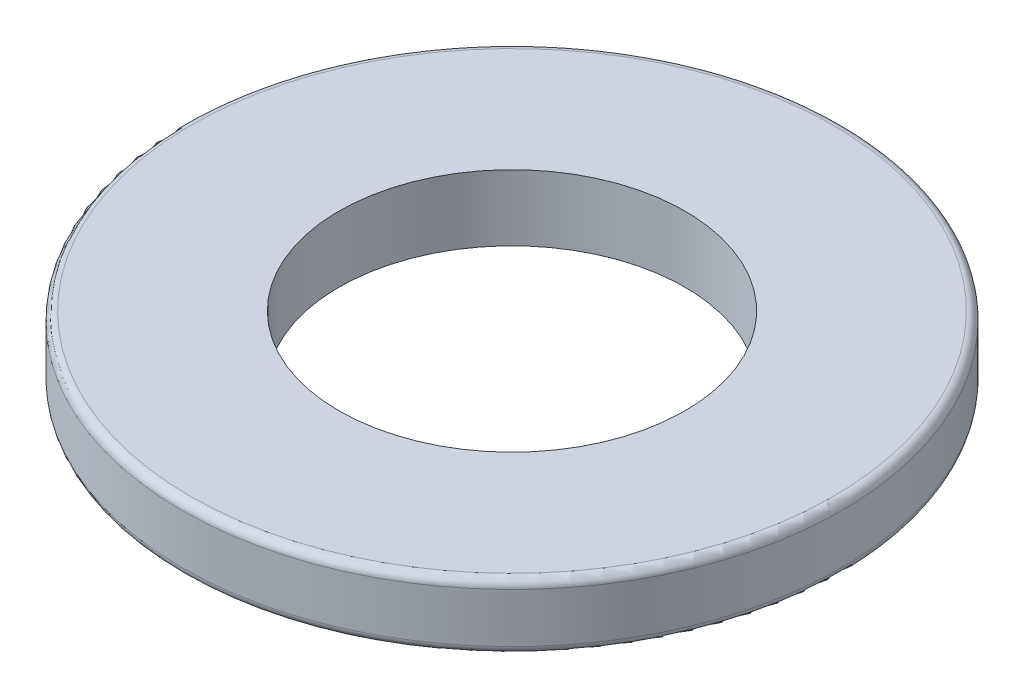
ISO-10303-21;
HEADER;
FILE_DESCRIPTION(('STEP AP214'),'2;1');
FILE_NAME('part.step','',(''),(''),'','','');
FILE_SCHEMA(('AUTOMOTIVE_DESIGN { 1 0 10303 214 1 1 1 1 }'));
ENDSEC;
DATA;
#1=APPLICATION_CONTEXT('core data for automotive mechanical design processes');
#2=APPLICATION_PROTOCOL_DEFINITION('international standard','automotive_design',2000,#1);
#3=PRODUCT_CONTEXT('',#1,'mechanical');
#4=PRODUCT('Part','Part','',(#3));
#5=PRODUCT_RELATED_PRODUCT_CATEGORY('part','',(#4));
#6=PRODUCT_DEFINITION_FORMATION('','',#4);
#7=PRODUCT_DEFINITION_CONTEXT('part definition',#1,'design');
#8=PRODUCT_DEFINITION('design','',#6,#7);
#9=PRODUCT_DEFINITION_SHAPE('','',#8);
#10=(LENGTH_UNIT() NAMED_UNIT(*) SI_UNIT(.MILLI.,.METRE.));
#11=(NAMED_UNIT(*) PLANE_ANGLE_UNIT() SI_UNIT($,.RADIAN.));
#12=(NAMED_UNIT(*) SI_UNIT($,.STERADIAN.) SOLID_ANGLE_UNIT());
#13=UNCERTAINTY_MEASURE_WITH_UNIT(LENGTH_MEASURE(1.E-05),#10,'distance_accuracy_value','');
#14=(GEOMETRIC_REPRESENTATION_CONTEXT(3) GLOBAL_UNCERTAINTY_ASSIGNED_CONTEXT((#13)) GLOBAL_UNIT_ASSIGNED_CONTEXT((#10,
#11,#12)) REPRESENTATION_CONTEXT('',''));
#15=CARTESIAN_POINT('',(0.,0.,0.));
#16=DIRECTION('',(0.,0.,1.));
#17=DIRECTION('',(1.,0.,0.));
#18=AXIS2_PLACEMENT_3D('',#15,#16,#17);
#19=CARTESIAN_POINT('',(0.,1.6,-17.0025112849849));
#20=DIRECTION('',(0.,1.,0.));
#21=DIRECTION('',(0.,0.,1.));
#22=AXIS2_PLACEMENT_3D('',#19,#20,#21);
#23=PLANE('',#22);
#24=CARTESIAN_POINT('',(0.,1.6,-17.0025112849849));
#25=DIRECTION('',(0.,1.,0.));
#26=DIRECTION('',(0.,0.,1.));
#27=AXIS2_PLACEMENT_3D('',#24,#25,#26);
#28=CIRCLE('',#27,7.8);
#29=CARTESIAN_POINT('',(0.,1.6,-9.20251128498494));
#30=VERTEX_POINT('',#29);
#31=EDGE_CURVE('E10',#30,#30,#28,.T.);
#32=ORIENTED_EDGE('',*,*,#31,.T.);
#33=EDGE_LOOP('',(#32));
#34=FACE_BOUND('',#33,.T.);
#35=CARTESIAN_POINT('',(0.,1.6,-17.0025112849849));
#36=DIRECTION('',(0.,1.,0.));
#37=DIRECTION('',(0.,0.,1.));
#38=AXIS2_PLACEMENT_3D('',#35,#36,#37);
#39=CIRCLE('',#38,4.2);
#40=CARTESIAN_POINT('',(0.,1.6,-12.8025112849849));
#41=VERTEX_POINT('',#40);
#42=EDGE_CURVE('E52',#41,#41,#39,.T.);
#43=ORIENTED_EDGE('',*,*,#42,.F.);
#44=EDGE_LOOP('',(#43));
#45=FACE_BOUND('',#44,.T.);
#46=ADVANCED_FACE('F32',(#34,#45),#23,.T.);
#47=CARTESIAN_POINT('',(0.,0.,-17.0025112849849));
#48=DIRECTION('',(0.,1.,0.));
#49=DIRECTION('',(0.,0.,1.));
#50=AXIS2_PLACEMENT_3D('',#47,#48,#49);
#51=PLANE('',#50);
#52=CARTESIAN_POINT('',(0.,0.,-17.0025112849849));
#53=DIRECTION('',(0.,1.,0.));
#54=DIRECTION('',(0.,0.,1.));
#55=AXIS2_PLACEMENT_3D('',#52,#53,#54);
#56=CIRCLE('',#55,7.8);
#57=CARTESIAN_POINT('',(0.,0.,-9.20251128498494));
#58=VERTEX_POINT('',#57);
#59=EDGE_CURVE('E39',#58,#58,#56,.F.);
#60=ORIENTED_EDGE('',*,*,#59,.T.);
#61=EDGE_LOOP('',(#60));
#62=FACE_BOUND('',#61,.T.);
#63=CARTESIAN_POINT('',(0.,0.,-17.0025112849849));
#64=DIRECTION('',(0.,1.,0.));
#65=DIRECTION('',(0.,0.,1.));
#66=AXIS2_PLACEMENT_3D('',#63,#64,#65);
#67=CIRCLE('',#66,4.2);
#68=CARTESIAN_POINT('',(0.,0.,-12.8025112849849));
#69=VERTEX_POINT('',#68);
#70=EDGE_CURVE('E53',#69,#69,#67,.T.);
#71=ORIENTED_EDGE('',*,*,#70,.T.);
#72=EDGE_LOOP('',(#71));
#73=FACE_BOUND('',#72,.T.);
#74=ADVANCED_FACE('F63',(#62,#73),#51,.F.);
#75=CARTESIAN_POINT('',(0.,1.6,-17.0025112849849));
#76=DIRECTION('',(0.,-1.,0.));
#77=DIRECTION('',(0.,0.,-1.));
#78=AXIS2_PLACEMENT_3D('',#75,#76,#77);
#79=CYLINDRICAL_SURFACE('',#78,8.);
#80=CARTESIAN_POINT('',(0.,0.2,-17.0025112849849));
#81=DIRECTION('',(0.,1.,0.));
#82=DIRECTION('',(0.,0.,1.));
#83=AXIS2_PLACEMENT_3D('',#80,#81,#82);
#84=CIRCLE('',#83,8.);
#85=CARTESIAN_POINT('',(0.,0.2,-9.00251128498494));
#86=VERTEX_POINT('',#85);
#87=EDGE_CURVE('E43',#86,#86,#84,.T.);
#88=ORIENTED_EDGE('',*,*,#87,.T.);
#89=EDGE_LOOP('',(#88));
#90=FACE_BOUND('',#89,.T.);
#91=CARTESIAN_POINT('',(0.,1.4,-17.0025112849849));
#92=DIRECTION('',(0.,1.,0.));
#93=DIRECTION('',(0.,0.,1.));
#94=AXIS2_PLACEMENT_3D('',#91,#92,#93);
#95=CIRCLE('',#94,8.);
#96=CARTESIAN_POINT('',(0.,1.4,-9.00251128498494));
#97=VERTEX_POINT('',#96);
#98=EDGE_CURVE('E47',#97,#97,#95,.F.);
#99=ORIENTED_EDGE('',*,*,#98,.T.);
#100=EDGE_LOOP('',(#99));
#101=FACE_BOUND('',#100,.T.);
#102=ADVANCED_FACE('F68',(#90,#101),#79,.T.);
#103=CARTESIAN_POINT('',(0.,1.6,-17.0025112849849));
#104=DIRECTION('',(0.,-1.,0.));
#105=DIRECTION('',(0.,0.,-1.));
#106=AXIS2_PLACEMENT_3D('',#103,#104,#105);
#107=CYLINDRICAL_SURFACE('',#106,4.2);
#108=ORIENTED_EDGE('',*,*,#42,.T.);
#109=EDGE_LOOP('',(#108));
#110=FACE_BOUND('',#109,.T.);
#111=ORIENTED_EDGE('',*,*,#70,.F.);
#112=EDGE_LOOP('',(#111));
#113=FACE_BOUND('',#112,.T.);
#114=ADVANCED_FACE('F59',(#110,#113),#107,.F.);
#115=CARTESIAN_POINT('',(0.,0.2,-17.0025112849849));
#116=DIRECTION('',(0.,1.,0.));
#117=DIRECTION('',(0.,0.,1.));
#118=AXIS2_PLACEMENT_3D('',#115,#116,#117);
#119=TOROIDAL_SURFACE('',#118,7.8,0.2);
#120=ORIENTED_EDGE('',*,*,#59,.F.);
#121=EDGE_LOOP('',(#120));
#122=FACE_BOUND('',#121,.T.);
#123=ORIENTED_EDGE('',*,*,#87,.F.);
#124=EDGE_LOOP('',(#123));
#125=FACE_BOUND('',#124,.T.);
#126=ADVANCED_FACE('F74',(#122,#125),#119,.T.);
#127=CARTESIAN_POINT('',(0.,1.4,-17.0025112849849));
#128=DIRECTION('',(0.,1.,0.));
#129=DIRECTION('',(0.,0.,1.));
#130=AXIS2_PLACEMENT_3D('',#127,#128,#129);
#131=TOROIDAL_SURFACE('',#130,7.8,0.2);
#132=ORIENTED_EDGE('',*,*,#98,.F.);
#133=EDGE_LOOP('',(#132));
#134=FACE_BOUND('',#133,.T.);
#135=ORIENTED_EDGE('',*,*,#31,.F.);
#136=EDGE_LOOP('',(#135));
#137=FACE_BOUND('',#136,.T.);
#138=ADVANCED_FACE('F34',(#134,#137),#131,.T.);
#139=CLOSED_SHELL('',(#46,#74,#102,#114,#126,#138));
#140=MANIFOLD_SOLID_BREP('B2',#139);
#141=ADVANCED_BREP_SHAPE_REPRESENTATION('',(#18,#140),#14);
#142=SHAPE_DEFINITION_REPRESENTATION(#9,#141);
ENDSEC;
END-ISO-10303-21;
